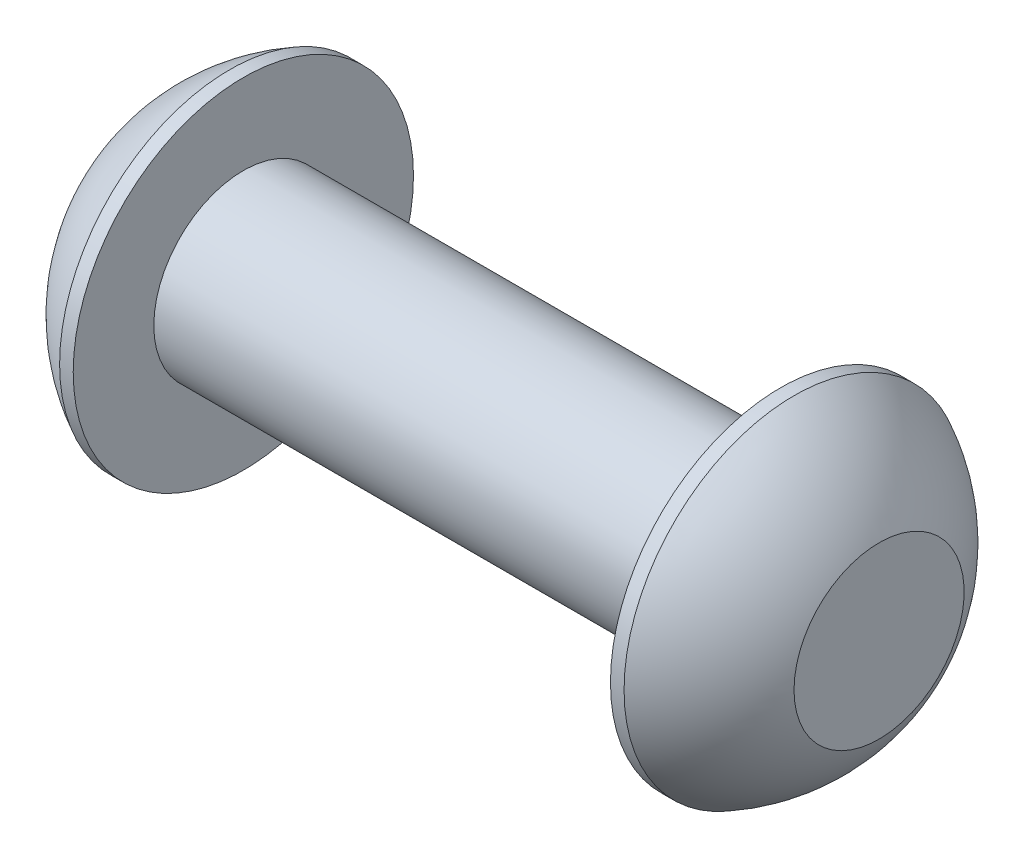
ISO-10303-21;
HEADER;
FILE_DESCRIPTION(('STEP AP214'),'2;1');
FILE_NAME('part.step','',(''),(''),'','','');
FILE_SCHEMA(('AUTOMOTIVE_DESIGN { 1 0 10303 214 1 1 1 1 }'));
ENDSEC;
DATA;
#1=APPLICATION_CONTEXT('core data for automotive mechanical design processes');
#2=APPLICATION_PROTOCOL_DEFINITION('international standard','automotive_design',2000,#1);
#3=PRODUCT_CONTEXT('',#1,'mechanical');
#4=PRODUCT('Part','Part','',(#3));
#5=PRODUCT_RELATED_PRODUCT_CATEGORY('part','',(#4));
#6=PRODUCT_DEFINITION_FORMATION('','',#4);
#7=PRODUCT_DEFINITION_CONTEXT('part definition',#1,'design');
#8=PRODUCT_DEFINITION('design','',#6,#7);
#9=PRODUCT_DEFINITION_SHAPE('','',#8);
#10=(LENGTH_UNIT() NAMED_UNIT(*) SI_UNIT(.MILLI.,.METRE.));
#11=(NAMED_UNIT(*) PLANE_ANGLE_UNIT() SI_UNIT($,.RADIAN.));
#12=(NAMED_UNIT(*) SI_UNIT($,.STERADIAN.) SOLID_ANGLE_UNIT());
#13=UNCERTAINTY_MEASURE_WITH_UNIT(LENGTH_MEASURE(1.E-05),#10,'distance_accuracy_value','');
#14=(GEOMETRIC_REPRESENTATION_CONTEXT(3) GLOBAL_UNCERTAINTY_ASSIGNED_CONTEXT((#13)) GLOBAL_UNIT_ASSIGNED_CONTEXT((#10,
#11,#12)) REPRESENTATION_CONTEXT('',''));
#15=CARTESIAN_POINT('',(0.,0.,0.));
#16=DIRECTION('',(0.,0.,1.));
#17=DIRECTION('',(1.,0.,0.));
#18=AXIS2_PLACEMENT_3D('',#15,#16,#17);
#19=CARTESIAN_POINT('',(4.75501582278481,0.,0.));
#20=DIRECTION('',(-1.,0.,0.));
#21=DIRECTION('',(0.,1.,0.));
#22=AXIS2_PLACEMENT_3D('',#19,#20,#21);
#23=SPHERICAL_SURFACE('',#22,5.3151482081814);
#24=CARTESIAN_POINT('',(2.37,0.,0.));
#25=DIRECTION('',(-1.,0.,0.));
#26=DIRECTION('',(0.,0.,1.));
#27=AXIS2_PLACEMENT_3D('',#24,#25,#26);
#28=CIRCLE('',#27,4.75);
#29=CARTESIAN_POINT('',(2.37,0.,4.75));
#30=VERTEX_POINT('',#29);
#31=EDGE_CURVE('E60',#30,#30,#28,.T.);
#32=ORIENTED_EDGE('',*,*,#31,.T.);
#33=EDGE_LOOP('',(#32));
#34=FACE_BOUND('',#33,.T.);
#35=CARTESIAN_POINT('',(0.,0.,0.));
#36=DIRECTION('',(-1.,0.,0.));
#37=DIRECTION('',(0.,0.,1.));
#38=AXIS2_PLACEMENT_3D('',#35,#36,#37);
#39=CIRCLE('',#38,2.375);
#40=CARTESIAN_POINT('',(0.,0.,2.375));
#41=VERTEX_POINT('',#40);
#42=EDGE_CURVE('E10',#41,#41,#39,.T.);
#43=ORIENTED_EDGE('',*,*,#42,.F.);
#44=EDGE_LOOP('',(#43));
#45=FACE_BOUND('',#44,.T.);
#46=ADVANCED_FACE('F32',(#34,#45),#23,.T.);
#47=CARTESIAN_POINT('',(0.,0.,0.));
#48=DIRECTION('',(-1.,0.,0.));
#49=DIRECTION('',(0.,0.,1.));
#50=AXIS2_PLACEMENT_3D('',#47,#48,#49);
#51=PLANE('',#50);
#52=ORIENTED_EDGE('',*,*,#42,.T.);
#53=EDGE_LOOP('',(#52));
#54=FACE_BOUND('',#53,.T.);
#55=ADVANCED_FACE('F96',(#54),#51,.T.);
#56=CARTESIAN_POINT('',(20.5,0.,0.));
#57=DIRECTION('',(-1.,0.,0.));
#58=DIRECTION('',(0.,0.,1.));
#59=AXIS2_PLACEMENT_3D('',#56,#57,#58);
#60=PLANE('',#59);
#61=CARTESIAN_POINT('',(20.5,0.,0.));
#62=DIRECTION('',(-1.,0.,0.));
#63=DIRECTION('',(0.,0.,1.));
#64=AXIS2_PLACEMENT_3D('',#61,#62,#63);
#65=CIRCLE('',#64,2.375);
#66=CARTESIAN_POINT('',(20.5,0.,2.375));
#67=VERTEX_POINT('',#66);
#68=EDGE_CURVE('E38',#67,#67,#65,.T.);
#69=ORIENTED_EDGE('',*,*,#68,.F.);
#70=EDGE_LOOP('',(#69));
#71=FACE_BOUND('',#70,.T.);
#72=ADVANCED_FACE('F100',(#71),#60,.F.);
#73=CARTESIAN_POINT('',(15.7449841772152,0.,0.));
#74=DIRECTION('',(-1.,0.,0.));
#75=DIRECTION('',(0.,1.,0.));
#76=AXIS2_PLACEMENT_3D('',#73,#74,#75);
#77=SPHERICAL_SURFACE('',#76,5.3151482081814);
#78=CARTESIAN_POINT('',(18.13,0.,0.));
#79=DIRECTION('',(-1.,0.,0.));
#80=DIRECTION('',(0.,0.,1.));
#81=AXIS2_PLACEMENT_3D('',#78,#79,#80);
#82=CIRCLE('',#81,4.74999999999999);
#83=CARTESIAN_POINT('',(18.13,0.,4.74999999999999));
#84=VERTEX_POINT('',#83);
#85=EDGE_CURVE('E42',#84,#84,#82,.T.);
#86=ORIENTED_EDGE('',*,*,#85,.F.);
#87=EDGE_LOOP('',(#86));
#88=FACE_BOUND('',#87,.T.);
#89=ORIENTED_EDGE('',*,*,#68,.T.);
#90=EDGE_LOOP('',(#89));
#91=FACE_BOUND('',#90,.T.);
#92=ADVANCED_FACE('F92',(#88,#91),#77,.T.);
#93=CARTESIAN_POINT('',(-1.17811458216011,0.,0.));
#94=DIRECTION('',(-1.,0.,0.));
#95=DIRECTION('',(0.,0.,1.));
#96=AXIS2_PLACEMENT_3D('',#93,#94,#95);
#97=CYLINDRICAL_SURFACE('',#96,4.74999999999999);
#98=ORIENTED_EDGE('',*,*,#85,.T.);
#99=EDGE_LOOP('',(#98));
#100=FACE_BOUND('',#99,.T.);
#101=CARTESIAN_POINT('',(17.75,0.,0.));
#102=DIRECTION('',(-1.,0.,0.));
#103=DIRECTION('',(0.,0.,1.));
#104=AXIS2_PLACEMENT_3D('',#101,#102,#103);
#105=CIRCLE('',#104,4.74999999999999);
#106=CARTESIAN_POINT('',(17.75,0.,4.74999999999999));
#107=VERTEX_POINT('',#106);
#108=EDGE_CURVE('E46',#107,#107,#105,.T.);
#109=ORIENTED_EDGE('',*,*,#108,.F.);
#110=EDGE_LOOP('',(#109));
#111=FACE_BOUND('',#110,.T.);
#112=ADVANCED_FACE('F86',(#100,#111),#97,.T.);
#113=CARTESIAN_POINT('',(17.75,0.,0.));
#114=DIRECTION('',(-1.,0.,0.));
#115=DIRECTION('',(0.,0.,1.));
#116=AXIS2_PLACEMENT_3D('',#113,#114,#115);
#117=PLANE('',#116);
#118=ORIENTED_EDGE('',*,*,#108,.T.);
#119=EDGE_LOOP('',(#118));
#120=FACE_BOUND('',#119,.T.);
#121=CARTESIAN_POINT('',(17.75,0.,0.));
#122=DIRECTION('',(-1.,0.,0.));
#123=DIRECTION('',(0.,0.,1.));
#124=AXIS2_PLACEMENT_3D('',#121,#122,#123);
#125=CIRCLE('',#124,2.5);
#126=CARTESIAN_POINT('',(17.75,0.,2.5));
#127=VERTEX_POINT('',#126);
#128=EDGE_CURVE('E51',#127,#127,#125,.T.);
#129=ORIENTED_EDGE('',*,*,#128,.F.);
#130=EDGE_LOOP('',(#129));
#131=FACE_BOUND('',#130,.T.);
#132=ADVANCED_FACE('F81',(#120,#131),#117,.T.);
#133=CARTESIAN_POINT('',(-1.17811458216011,0.,0.));
#134=DIRECTION('',(-1.,0.,0.));
#135=DIRECTION('',(0.,0.,1.));
#136=AXIS2_PLACEMENT_3D('',#133,#134,#135);
#137=CYLINDRICAL_SURFACE('',#136,2.5);
#138=CARTESIAN_POINT('',(2.75,0.,0.));
#139=DIRECTION('',(-1.,0.,0.));
#140=DIRECTION('',(0.,0.,1.));
#141=AXIS2_PLACEMENT_3D('',#138,#139,#140);
#142=CIRCLE('',#141,2.5);
#143=CARTESIAN_POINT('',(2.75,0.,2.5));
#144=VERTEX_POINT('',#143);
#145=EDGE_CURVE('E54',#144,#144,#142,.T.);
#146=ORIENTED_EDGE('',*,*,#145,.F.);
#147=EDGE_LOOP('',(#146));
#148=FACE_BOUND('',#147,.T.);
#149=ORIENTED_EDGE('',*,*,#128,.T.);
#150=EDGE_LOOP('',(#149));
#151=FACE_BOUND('',#150,.T.);
#152=ADVANCED_FACE('F75',(#148,#151),#137,.T.);
#153=CARTESIAN_POINT('',(2.75,0.,0.));
#154=DIRECTION('',(-1.,0.,0.));
#155=DIRECTION('',(0.,0.,1.));
#156=AXIS2_PLACEMENT_3D('',#153,#154,#155);
#157=PLANE('',#156);
#158=CARTESIAN_POINT('',(2.75,0.,0.));
#159=DIRECTION('',(-1.,0.,0.));
#160=DIRECTION('',(0.,0.,1.));
#161=AXIS2_PLACEMENT_3D('',#158,#159,#160);
#162=CIRCLE('',#161,4.75);
#163=CARTESIAN_POINT('',(2.75,0.,4.75));
#164=VERTEX_POINT('',#163);
#165=EDGE_CURVE('E57',#164,#164,#162,.T.);
#166=ORIENTED_EDGE('',*,*,#165,.F.);
#167=EDGE_LOOP('',(#166));
#168=FACE_BOUND('',#167,.T.);
#169=ORIENTED_EDGE('',*,*,#145,.T.);
#170=EDGE_LOOP('',(#169));
#171=FACE_BOUND('',#170,.T.);
#172=ADVANCED_FACE('F69',(#168,#171),#157,.F.);
#173=CARTESIAN_POINT('',(-1.17811458216011,0.,0.));
#174=DIRECTION('',(-1.,0.,0.));
#175=DIRECTION('',(0.,0.,1.));
#176=AXIS2_PLACEMENT_3D('',#173,#174,#175);
#177=CYLINDRICAL_SURFACE('',#176,4.75);
#178=ORIENTED_EDGE('',*,*,#31,.F.);
#179=EDGE_LOOP('',(#178));
#180=FACE_BOUND('',#179,.T.);
#181=ORIENTED_EDGE('',*,*,#165,.T.);
#182=EDGE_LOOP('',(#181));
#183=FACE_BOUND('',#182,.T.);
#184=ADVANCED_FACE('F66',(#180,#183),#177,.T.);
#185=CLOSED_SHELL('',(#46,#55,#72,#92,#112,#132,#152,#172,#184));
#186=MANIFOLD_SOLID_BREP('B2',#185);
#187=ADVANCED_BREP_SHAPE_REPRESENTATION('',(#18,#186),#14);
#188=SHAPE_DEFINITION_REPRESENTATION(#9,#187);
ENDSEC;
END-ISO-10303-21;
